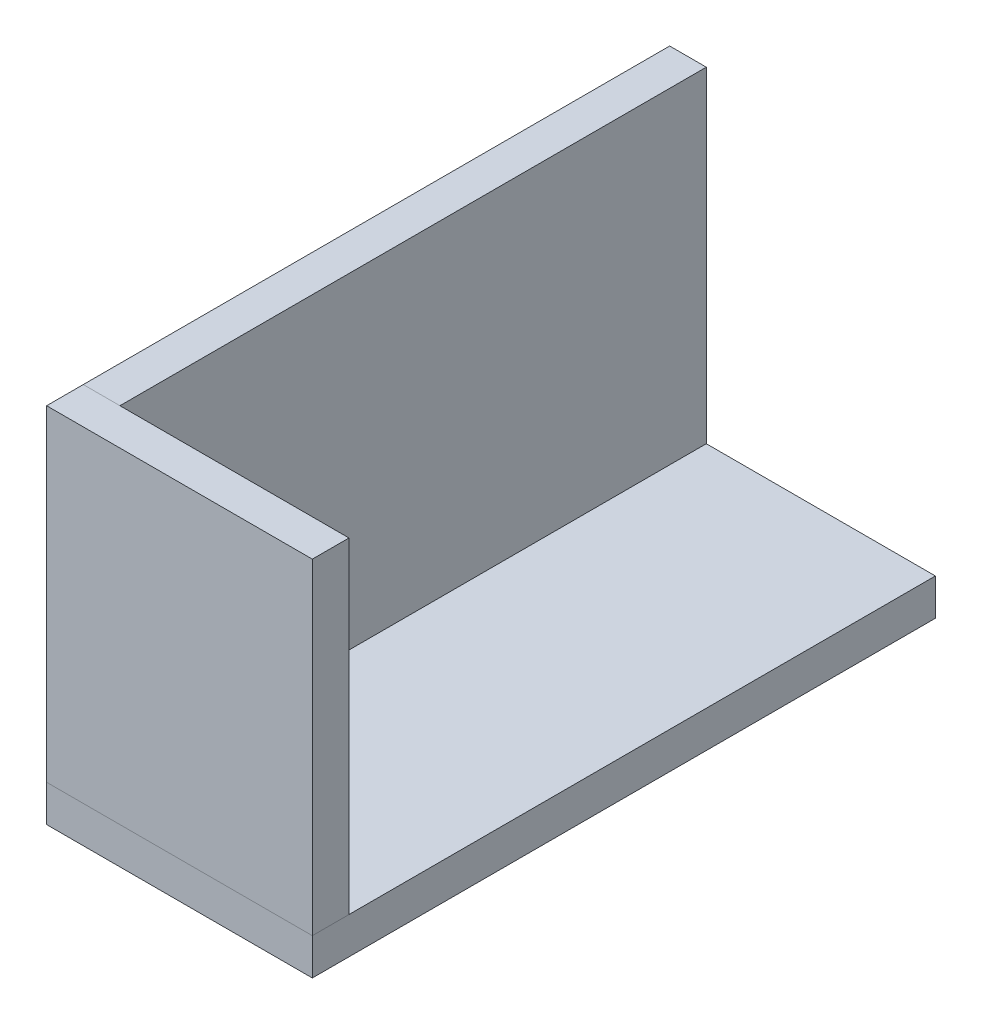
ISO-10303-21;
HEADER;
FILE_DESCRIPTION(('STEP AP214'),'2;1');
FILE_NAME('part.step','',(''),(''),'','','');
FILE_SCHEMA(('AUTOMOTIVE_DESIGN { 1 0 10303 214 1 1 1 1 }'));
ENDSEC;
DATA;
#1=APPLICATION_CONTEXT('core data for automotive mechanical design processes');
#2=APPLICATION_PROTOCOL_DEFINITION('international standard','automotive_design',2000,#1);
#3=PRODUCT_CONTEXT('',#1,'mechanical');
#4=PRODUCT('Part','Part','',(#3));
#5=PRODUCT_RELATED_PRODUCT_CATEGORY('part','',(#4));
#6=PRODUCT_DEFINITION_FORMATION('','',#4);
#7=PRODUCT_DEFINITION_CONTEXT('part definition',#1,'design');
#8=PRODUCT_DEFINITION('design','',#6,#7);
#9=PRODUCT_DEFINITION_SHAPE('','',#8);
#10=(LENGTH_UNIT() NAMED_UNIT(*) SI_UNIT(.MILLI.,.METRE.));
#11=(NAMED_UNIT(*) PLANE_ANGLE_UNIT() SI_UNIT($,.RADIAN.));
#12=(NAMED_UNIT(*) SI_UNIT($,.STERADIAN.) SOLID_ANGLE_UNIT());
#13=UNCERTAINTY_MEASURE_WITH_UNIT(LENGTH_MEASURE(1.E-05),#10,'distance_accuracy_value','');
#14=(GEOMETRIC_REPRESENTATION_CONTEXT(3) GLOBAL_UNCERTAINTY_ASSIGNED_CONTEXT((#13)) GLOBAL_UNIT_ASSIGNED_CONTEXT((#10,
#11,#12)) REPRESENTATION_CONTEXT('',''));
#15=CARTESIAN_POINT('',(0.,0.,0.));
#16=DIRECTION('',(0.,0.,1.));
#17=DIRECTION('',(1.,0.,0.));
#18=AXIS2_PLACEMENT_3D('',#15,#16,#17);
#19=CARTESIAN_POINT('',(-339.725,6858.02749999999,2899.41));
#20=DIRECTION('',(0.,-1.,0.));
#21=DIRECTION('',(0.,0.,-1.));
#22=AXIS2_PLACEMENT_3D('',#19,#20,#21);
#23=PLANE('',#22);
#24=CARTESIAN_POINT('',(-339.725,6858.02749999999,2855.31590000001));
#25=DIRECTION('',(0.,1.,0.));
#26=DIRECTION('',(0.,0.,1.));
#27=AXIS2_PLACEMENT_3D('',#24,#25,#26);
#28=CIRCLE('',#27,3.50000000000002);
#29=CARTESIAN_POINT('',(-339.725,6858.02749999999,2858.81590000001));
#30=VERTEX_POINT('',#29);
#31=EDGE_CURVE('P0_E83',#30,#30,#28,.T.);
#32=ORIENTED_EDGE('',*,*,#31,.T.);
#33=EDGE_LOOP('',(#32));
#34=FACE_BOUND('',#33,.T.);
#35=CARTESIAN_POINT('',(-339.725,6858.02749999999,2877.35040000001));
#36=DIRECTION('',(0.,1.,0.));
#37=DIRECTION('',(0.,0.,1.));
#38=AXIS2_PLACEMENT_3D('',#35,#36,#37);
#39=CIRCLE('',#38,3.50000000000002);
#40=CARTESIAN_POINT('',(-339.725,6858.02749999999,2880.85040000001));
#41=VERTEX_POINT('',#40);
#42=EDGE_CURVE('P0_E20',#41,#41,#39,.T.);
#43=ORIENTED_EDGE('',*,*,#42,.T.);
#44=EDGE_LOOP('',(#43));
#45=FACE_BOUND('',#44,.T.);
#46=DIRECTION('',(0.,0.,1.));
#47=VECTOR('',#46,1.);
#48=CARTESIAN_POINT('',(-377.825,6858.02749999999,2791.46));
#49=LINE('',#48,#47);
#50=CARTESIAN_POINT('',(-377.825,6858.02749999999,2683.51));
#51=VERTEX_POINT('',#50);
#52=CARTESIAN_POINT('',(-377.825,6858.02749999999,2899.41));
#53=VERTEX_POINT('',#52);
#54=EDGE_CURVE('P0_E70',#51,#53,#49,.T.);
#55=ORIENTED_EDGE('',*,*,#54,.F.);
#56=DIRECTION('',(-1.,0.,0.));
#57=VECTOR('',#56,1.);
#58=CARTESIAN_POINT('',(-339.725,6858.02749999999,2683.51));
#59=LINE('',#58,#57);
#60=CARTESIAN_POINT('',(-285.750000000016,6858.02749999999,2683.51));
#61=VERTEX_POINT('',#60);
#62=EDGE_CURVE('P0_E55',#61,#51,#59,.T.);
#63=ORIENTED_EDGE('',*,*,#62,.F.);
#64=DIRECTION('',(0.,0.,1.));
#65=VECTOR('',#64,1.);
#66=CARTESIAN_POINT('',(-285.750000000012,6858.02749999999,2791.46));
#67=LINE('',#66,#65);
#68=CARTESIAN_POINT('',(-285.750000000011,6858.02749999999,2899.41));
#69=VERTEX_POINT('',#68);
#70=EDGE_CURVE('P0_E60',#61,#69,#67,.T.);
#71=ORIENTED_EDGE('',*,*,#70,.T.);
#72=DIRECTION('',(1.,0.,0.));
#73=VECTOR('',#72,1.);
#74=CARTESIAN_POINT('',(-339.725,6858.02749999999,2899.41));
#75=LINE('',#74,#73);
#76=EDGE_CURVE('P0_E90',#53,#69,#75,.T.);
#77=ORIENTED_EDGE('',*,*,#76,.F.);
#78=EDGE_LOOP('',(#55,#63,#71,#77));
#79=FACE_BOUND('',#78,.T.);
#80=ADVANCED_FACE('P0_F17',(#34,#45,#79),#23,.T.);
#81=CARTESIAN_POINT('',(-285.750000000013,6864.37749999999,2791.46));
#82=DIRECTION('',(-1.,-1.19356260075187E-13,0.));
#83=DIRECTION('',(1.19356260075187E-13,-1.,0.));
#84=AXIS2_PLACEMENT_3D('',#81,#82,#83);
#85=PLANE('',#84);
#86=DIRECTION('',(0.,0.,1.));
#87=VECTOR('',#86,1.);
#88=CARTESIAN_POINT('',(-285.75000000001,6870.72749999999,2683.51));
#89=LINE('',#88,#87);
#90=CARTESIAN_POINT('',(-285.75000000001,6870.72749999999,2899.41));
#91=VERTEX_POINT('',#90);
#92=CARTESIAN_POINT('',(-285.750000000015,6870.72749999999,2683.51));
#93=VERTEX_POINT('',#92);
#94=EDGE_CURVE('P0_E85',#91,#93,#89,.F.);
#95=ORIENTED_EDGE('',*,*,#94,.F.);
#96=DIRECTION('',(0.,1.,0.));
#97=VECTOR('',#96,1.);
#98=CARTESIAN_POINT('',(-285.75000000001,6870.72749999999,2899.41));
#99=LINE('',#98,#97);
#100=EDGE_CURVE('P0_E65',#69,#91,#99,.T.);
#101=ORIENTED_EDGE('',*,*,#100,.F.);
#102=ORIENTED_EDGE('',*,*,#70,.F.);
#103=DIRECTION('',(0.,1.,0.));
#104=VECTOR('',#103,1.);
#105=CARTESIAN_POINT('',(-285.750000000018,6858.02749999999,2683.51));
#106=LINE('',#105,#104);
#107=EDGE_CURVE('P0_E62',#93,#61,#106,.F.);
#108=ORIENTED_EDGE('',*,*,#107,.F.);
#109=EDGE_LOOP('',(#95,#101,#102,#108));
#110=FACE_BOUND('',#109,.T.);
#111=ADVANCED_FACE('P0_F61',(#110),#85,.F.);
#112=CARTESIAN_POINT('',(-339.725,6858.02749999999,2683.51));
#113=DIRECTION('',(0.,0.,-1.));
#114=DIRECTION('',(-1.,0.,0.));
#115=AXIS2_PLACEMENT_3D('',#112,#113,#114);
#116=PLANE('',#115);
#117=DIRECTION('',(0.,1.,0.));
#118=VECTOR('',#117,1.);
#119=CARTESIAN_POINT('',(-377.825,6864.37749999999,2683.51));
#120=LINE('',#119,#118);
#121=CARTESIAN_POINT('',(-377.825,6870.72749999999,2683.51));
#122=VERTEX_POINT('',#121);
#123=EDGE_CURVE('P0_E72',#122,#51,#120,.F.);
#124=ORIENTED_EDGE('',*,*,#123,.F.);
#125=DIRECTION('',(1.,0.,0.));
#126=VECTOR('',#125,1.);
#127=CARTESIAN_POINT('',(-339.725,6870.72749999999,2683.51));
#128=LINE('',#127,#126);
#129=EDGE_CURVE('P0_E76',#93,#122,#128,.F.);
#130=ORIENTED_EDGE('',*,*,#129,.F.);
#131=ORIENTED_EDGE('',*,*,#107,.T.);
#132=ORIENTED_EDGE('',*,*,#62,.T.);
#133=EDGE_LOOP('',(#124,#130,#131,#132));
#134=FACE_BOUND('',#133,.T.);
#135=ADVANCED_FACE('P0_F74',(#134),#116,.T.);
#136=CARTESIAN_POINT('',(-377.825,6864.37749999999,2791.46));
#137=DIRECTION('',(-1.,0.,0.));
#138=DIRECTION('',(0.,0.,1.));
#139=AXIS2_PLACEMENT_3D('',#136,#137,#138);
#140=PLANE('',#139);
#141=ORIENTED_EDGE('',*,*,#54,.T.);
#142=DIRECTION('',(0.,1.,0.));
#143=VECTOR('',#142,1.);
#144=CARTESIAN_POINT('',(-377.825,6870.72749999999,2899.41));
#145=LINE('',#144,#143);
#146=CARTESIAN_POINT('',(-377.825,6870.72749999999,2899.41));
#147=VERTEX_POINT('',#146);
#148=EDGE_CURVE('P0_E35',#147,#53,#145,.F.);
#149=ORIENTED_EDGE('',*,*,#148,.F.);
#150=DIRECTION('',(0.,0.,1.));
#151=VECTOR('',#150,1.);
#152=CARTESIAN_POINT('',(-377.825,6870.72749999999,2683.51));
#153=LINE('',#152,#151);
#154=EDGE_CURVE('P0_E101',#122,#147,#153,.T.);
#155=ORIENTED_EDGE('',*,*,#154,.F.);
#156=ORIENTED_EDGE('',*,*,#123,.T.);
#157=EDGE_LOOP('',(#141,#149,#155,#156));
#158=FACE_BOUND('',#157,.T.);
#159=ADVANCED_FACE('P0_F99',(#158),#140,.T.);
#160=CARTESIAN_POINT('',(-339.725,6870.72749999999,2899.41));
#161=DIRECTION('',(0.,0.,1.));
#162=DIRECTION('',(1.,0.,0.));
#163=AXIS2_PLACEMENT_3D('',#160,#161,#162);
#164=PLANE('',#163);
#165=ORIENTED_EDGE('',*,*,#148,.T.);
#166=ORIENTED_EDGE('',*,*,#76,.T.);
#167=ORIENTED_EDGE('',*,*,#100,.T.);
#168=DIRECTION('',(1.,0.,0.));
#169=VECTOR('',#168,1.);
#170=CARTESIAN_POINT('',(-339.725,6870.72749999999,2899.41));
#171=LINE('',#170,#169);
#172=EDGE_CURVE('P0_E82',#147,#91,#171,.T.);
#173=ORIENTED_EDGE('',*,*,#172,.F.);
#174=EDGE_LOOP('',(#165,#166,#167,#173));
#175=FACE_BOUND('',#174,.T.);
#176=ADVANCED_FACE('P0_F107',(#175),#164,.T.);
#177=CARTESIAN_POINT('',(-339.725,6858.02749999999,2877.35040000001));
#178=DIRECTION('',(0.,1.,0.));
#179=DIRECTION('',(0.,0.,1.));
#180=AXIS2_PLACEMENT_3D('',#177,#178,#179);
#181=CYLINDRICAL_SURFACE('',#180,3.50000000000002);
#182=ORIENTED_EDGE('',*,*,#42,.F.);
#183=EDGE_LOOP('',(#182));
#184=FACE_BOUND('',#183,.T.);
#185=CARTESIAN_POINT('',(-339.725,6870.72749999999,2877.35040000001));
#186=DIRECTION('',(0.,1.,0.));
#187=DIRECTION('',(0.,0.,1.));
#188=AXIS2_PLACEMENT_3D('',#185,#186,#187);
#189=CIRCLE('',#188,3.50000000000002);
#190=CARTESIAN_POINT('',(-339.725,6870.72749999999,2880.85040000001));
#191=VERTEX_POINT('',#190);
#192=EDGE_CURVE('P0_E26',#191,#191,#189,.F.);
#193=ORIENTED_EDGE('',*,*,#192,.F.);
#194=EDGE_LOOP('',(#193));
#195=FACE_BOUND('',#194,.T.);
#196=ADVANCED_FACE('P0_F109',(#184,#195),#181,.F.);
#197=CARTESIAN_POINT('',(-339.725,6858.02749999999,2855.31590000001));
#198=DIRECTION('',(0.,1.,0.));
#199=DIRECTION('',(0.,0.,1.));
#200=AXIS2_PLACEMENT_3D('',#197,#198,#199);
#201=CYLINDRICAL_SURFACE('',#200,3.50000000000002);
#202=ORIENTED_EDGE('',*,*,#31,.F.);
#203=EDGE_LOOP('',(#202));
#204=FACE_BOUND('',#203,.T.);
#205=CARTESIAN_POINT('',(-339.725,6870.72749999999,2855.31590000001));
#206=DIRECTION('',(0.,1.,0.));
#207=DIRECTION('',(0.,0.,1.));
#208=AXIS2_PLACEMENT_3D('',#205,#206,#207);
#209=CIRCLE('',#208,3.50000000000002);
#210=CARTESIAN_POINT('',(-339.725,6870.72749999999,2858.81590000001));
#211=VERTEX_POINT('',#210);
#212=EDGE_CURVE('P0_E11',#211,#211,#209,.F.);
#213=ORIENTED_EDGE('',*,*,#212,.F.);
#214=EDGE_LOOP('',(#213));
#215=FACE_BOUND('',#214,.T.);
#216=ADVANCED_FACE('P0_F116',(#204,#215),#201,.F.);
#217=CARTESIAN_POINT('',(-339.725,6870.72749999999,2683.51));
#218=DIRECTION('',(0.,1.,0.));
#219=DIRECTION('',(0.,0.,1.));
#220=AXIS2_PLACEMENT_3D('',#217,#218,#219);
#221=PLANE('',#220);
#222=ORIENTED_EDGE('',*,*,#212,.T.);
#223=EDGE_LOOP('',(#222));
#224=FACE_BOUND('',#223,.T.);
#225=ORIENTED_EDGE('',*,*,#192,.T.);
#226=EDGE_LOOP('',(#225));
#227=FACE_BOUND('',#226,.T.);
#228=ORIENTED_EDGE('',*,*,#154,.T.);
#229=ORIENTED_EDGE('',*,*,#172,.T.);
#230=ORIENTED_EDGE('',*,*,#94,.T.);
#231=ORIENTED_EDGE('',*,*,#129,.T.);
#232=EDGE_LOOP('',(#228,#229,#230,#231));
#233=FACE_BOUND('',#232,.T.);
#234=ADVANCED_FACE('P0_F105',(#224,#227,#233),#221,.T.);
#235=CLOSED_SHELL('',(#80,#111,#135,#159,#176,#196,#216,#234));
#236=MANIFOLD_SOLID_BREP('P0_B1',#235);
#237=CARTESIAN_POINT('',(-377.825,6870.72749999999,2899.41));
#238=DIRECTION('',(0.,0.,1.));
#239=DIRECTION('',(1.,0.,0.));
#240=AXIS2_PLACEMENT_3D('',#237,#238,#239);
#241=PLANE('',#240);
#242=DIRECTION('',(1.,0.,0.));
#243=VECTOR('',#242,1.);
#244=CARTESIAN_POINT('',(-331.787500000005,6870.72749999999,2899.41));
#245=LINE('',#244,#243);
#246=CARTESIAN_POINT('',(-377.825,6870.72749999999,2899.41));
#247=VERTEX_POINT('',#246);
#248=CARTESIAN_POINT('',(-285.75000000001,6870.72749999999,2899.41));
#249=VERTEX_POINT('',#248);
#250=EDGE_CURVE('P1_E55',#247,#249,#245,.T.);
#251=ORIENTED_EDGE('',*,*,#250,.T.);
#252=DIRECTION('',(0.,1.,0.));
#253=VECTOR('',#252,1.);
#254=CARTESIAN_POINT('',(-285.75000000001,6870.72749999999,2899.41));
#255=LINE('',#254,#253);
#256=CARTESIAN_POINT('',(-285.75000000001,6983.72999014005,2899.41));
#257=VERTEX_POINT('',#256);
#258=EDGE_CURVE('P1_E67',#257,#249,#255,.F.);
#259=ORIENTED_EDGE('',*,*,#258,.F.);
#260=DIRECTION('',(1.,1.19356260075187E-13,0.));
#261=VECTOR('',#260,1.);
#262=CARTESIAN_POINT('',(-331.787500000005,6983.72999014005,2899.41));
#263=LINE('',#262,#261);
#264=CARTESIAN_POINT('',(-377.825,6983.72999014005,2899.41));
#265=VERTEX_POINT('',#264);
#266=EDGE_CURVE('P1_E20',#257,#265,#263,.F.);
#267=ORIENTED_EDGE('',*,*,#266,.T.);
#268=DIRECTION('',(0.,1.,0.));
#269=VECTOR('',#268,1.);
#270=CARTESIAN_POINT('',(-377.825,6870.72749999999,2899.41));
#271=LINE('',#270,#269);
#272=EDGE_CURVE('P1_E81',#247,#265,#271,.T.);
#273=ORIENTED_EDGE('',*,*,#272,.F.);
#274=EDGE_LOOP('',(#251,#259,#267,#273));
#275=FACE_BOUND('',#274,.T.);
#276=ADVANCED_FACE('P1_F17',(#275),#241,.T.);
#277=CARTESIAN_POINT('',(-331.787500000005,6983.72999014005,2893.06));
#278=DIRECTION('',(1.19356260075187E-13,-1.,0.));
#279=DIRECTION('',(1.,1.19356260075187E-13,0.));
#280=AXIS2_PLACEMENT_3D('',#277,#278,#279);
#281=PLANE('',#280);
#282=DIRECTION('',(0.,0.,1.));
#283=VECTOR('',#282,1.);
#284=CARTESIAN_POINT('',(-377.825,6983.72999014005,2886.71));
#285=LINE('',#284,#283);
#286=CARTESIAN_POINT('',(-377.825,6983.72999014005,2886.71));
#287=VERTEX_POINT('',#286);
#288=EDGE_CURVE('P1_E65',#265,#287,#285,.F.);
#289=ORIENTED_EDGE('',*,*,#288,.F.);
#290=ORIENTED_EDGE('',*,*,#266,.F.);
#291=DIRECTION('',(0.,0.,-1.));
#292=VECTOR('',#291,1.);
#293=CARTESIAN_POINT('',(-285.75000000001,6983.72999014005,2899.41));
#294=LINE('',#293,#292);
#295=CARTESIAN_POINT('',(-285.75000000001,6983.72999014005,2886.71));
#296=VERTEX_POINT('',#295);
#297=EDGE_CURVE('P1_E62',#296,#257,#294,.F.);
#298=ORIENTED_EDGE('',*,*,#297,.F.);
#299=DIRECTION('',(-1.,0.,0.));
#300=VECTOR('',#299,1.);
#301=CARTESIAN_POINT('',(-285.75000000001,6983.72999014005,2886.71));
#302=LINE('',#301,#300);
#303=EDGE_CURVE('P1_E83',#287,#296,#302,.F.);
#304=ORIENTED_EDGE('',*,*,#303,.F.);
#305=EDGE_LOOP('',(#289,#290,#298,#304));
#306=FACE_BOUND('',#305,.T.);
#307=ADVANCED_FACE('P1_F60',(#306),#281,.F.);
#308=CARTESIAN_POINT('',(-285.75000000001,6870.72749999999,2899.41));
#309=DIRECTION('',(1.,0.,0.));
#310=DIRECTION('',(0.,0.,-1.));
#311=AXIS2_PLACEMENT_3D('',#308,#309,#310);
#312=PLANE('',#311);
#313=DIRECTION('',(0.,0.,1.));
#314=VECTOR('',#313,1.);
#315=CARTESIAN_POINT('',(-285.75000000001,6870.72749999999,2893.06));
#316=LINE('',#315,#314);
#317=CARTESIAN_POINT('',(-285.75000000001,6870.72749999999,2886.71));
#318=VERTEX_POINT('',#317);
#319=EDGE_CURVE('P1_E77',#249,#318,#316,.F.);
#320=ORIENTED_EDGE('',*,*,#319,.T.);
#321=DIRECTION('',(0.,1.,0.));
#322=VECTOR('',#321,1.);
#323=CARTESIAN_POINT('',(-285.75000000001,6870.72749999999,2886.71));
#324=LINE('',#323,#322);
#325=EDGE_CURVE('P1_E73',#296,#318,#324,.F.);
#326=ORIENTED_EDGE('',*,*,#325,.F.);
#327=ORIENTED_EDGE('',*,*,#297,.T.);
#328=ORIENTED_EDGE('',*,*,#258,.T.);
#329=EDGE_LOOP('',(#320,#326,#327,#328));
#330=FACE_BOUND('',#329,.T.);
#331=ADVANCED_FACE('P1_F71',(#330),#312,.T.);
#332=CARTESIAN_POINT('',(-331.787500000005,6870.72749999999,2893.06));
#333=DIRECTION('',(0.,1.,0.));
#334=DIRECTION('',(0.,0.,1.));
#335=AXIS2_PLACEMENT_3D('',#332,#333,#334);
#336=PLANE('',#335);
#337=DIRECTION('',(-1.,0.,0.));
#338=VECTOR('',#337,1.);
#339=CARTESIAN_POINT('',(-285.75000000001,6870.72749999999,2886.71));
#340=LINE('',#339,#338);
#341=CARTESIAN_POINT('',(-377.825,6870.72749999999,2886.71));
#342=VERTEX_POINT('',#341);
#343=EDGE_CURVE('P1_E26',#318,#342,#340,.T.);
#344=ORIENTED_EDGE('',*,*,#343,.F.);
#345=ORIENTED_EDGE('',*,*,#319,.F.);
#346=ORIENTED_EDGE('',*,*,#250,.F.);
#347=DIRECTION('',(0.,0.,1.));
#348=VECTOR('',#347,1.);
#349=CARTESIAN_POINT('',(-377.825,6870.72749999999,2886.71));
#350=LINE('',#349,#348);
#351=EDGE_CURVE('P1_E35',#342,#247,#350,.T.);
#352=ORIENTED_EDGE('',*,*,#351,.F.);
#353=EDGE_LOOP('',(#344,#345,#346,#352));
#354=FACE_BOUND('',#353,.T.);
#355=ADVANCED_FACE('P1_F89',(#354),#336,.F.);
#356=CARTESIAN_POINT('',(-377.825,6870.72749999999,2886.71));
#357=DIRECTION('',(-1.,0.,0.));
#358=DIRECTION('',(0.,0.,1.));
#359=AXIS2_PLACEMENT_3D('',#356,#357,#358);
#360=PLANE('',#359);
#361=ORIENTED_EDGE('',*,*,#351,.T.);
#362=ORIENTED_EDGE('',*,*,#272,.T.);
#363=ORIENTED_EDGE('',*,*,#288,.T.);
#364=DIRECTION('',(0.,1.,0.));
#365=VECTOR('',#364,1.);
#366=CARTESIAN_POINT('',(-377.825,6870.72749999999,2886.71));
#367=LINE('',#366,#365);
#368=EDGE_CURVE('P1_E11',#342,#287,#367,.T.);
#369=ORIENTED_EDGE('',*,*,#368,.F.);
#370=EDGE_LOOP('',(#361,#362,#363,#369));
#371=FACE_BOUND('',#370,.T.);
#372=ADVANCED_FACE('P1_F91',(#371),#360,.T.);
#373=CARTESIAN_POINT('',(-285.75000000001,6870.72749999999,2886.71));
#374=DIRECTION('',(0.,0.,-1.));
#375=DIRECTION('',(-1.,0.,0.));
#376=AXIS2_PLACEMENT_3D('',#373,#374,#375);
#377=PLANE('',#376);
#378=ORIENTED_EDGE('',*,*,#343,.T.);
#379=ORIENTED_EDGE('',*,*,#368,.T.);
#380=ORIENTED_EDGE('',*,*,#303,.T.);
#381=ORIENTED_EDGE('',*,*,#325,.T.);
#382=EDGE_LOOP('',(#378,#379,#380,#381));
#383=FACE_BOUND('',#382,.T.);
#384=ADVANCED_FACE('P1_F88',(#383),#377,.T.);
#385=CLOSED_SHELL('',(#276,#307,#331,#355,#372,#384));
#386=MANIFOLD_SOLID_BREP('P1_B1',#385);
#387=CARTESIAN_POINT('',(-365.125,6870.72749999999,2886.71));
#388=DIRECTION('',(1.,0.,0.));
#389=DIRECTION('',(0.,0.,-1.));
#390=AXIS2_PLACEMENT_3D('',#387,#388,#389);
#391=PLANE('',#390);
#392=DIRECTION('',(0.,0.,1.));
#393=VECTOR('',#392,1.);
#394=CARTESIAN_POINT('',(-365.125,6870.72749999999,2785.11));
#395=LINE('',#394,#393);
#396=CARTESIAN_POINT('',(-365.125,6870.72749999999,2886.71));
#397=VERTEX_POINT('',#396);
#398=CARTESIAN_POINT('',(-365.125,6870.72749999999,2683.51));
#399=VERTEX_POINT('',#398);
#400=EDGE_CURVE('P2_E55',#397,#399,#395,.F.);
#401=ORIENTED_EDGE('',*,*,#400,.T.);
#402=DIRECTION('',(0.,1.,0.));
#403=VECTOR('',#402,1.);
#404=CARTESIAN_POINT('',(-365.125,6870.72749999999,2683.51));
#405=LINE('',#404,#403);
#406=CARTESIAN_POINT('',(-365.125,6983.72999014005,2683.51));
#407=VERTEX_POINT('',#406);
#408=EDGE_CURVE('P2_E67',#407,#399,#405,.F.);
#409=ORIENTED_EDGE('',*,*,#408,.F.);
#410=DIRECTION('',(0.,0.,1.));
#411=VECTOR('',#410,1.);
#412=CARTESIAN_POINT('',(-365.125,6983.72999014005,2785.11));
#413=LINE('',#412,#411);
#414=CARTESIAN_POINT('',(-365.125,6983.72999014005,2886.71));
#415=VERTEX_POINT('',#414);
#416=EDGE_CURVE('P2_E20',#407,#415,#413,.T.);
#417=ORIENTED_EDGE('',*,*,#416,.T.);
#418=DIRECTION('',(0.,1.,0.));
#419=VECTOR('',#418,1.);
#420=CARTESIAN_POINT('',(-365.125,6870.72749999999,2886.71));
#421=LINE('',#420,#419);
#422=EDGE_CURVE('P2_E81',#397,#415,#421,.T.);
#423=ORIENTED_EDGE('',*,*,#422,.F.);
#424=EDGE_LOOP('',(#401,#409,#417,#423));
#425=FACE_BOUND('',#424,.T.);
#426=ADVANCED_FACE('P2_F17',(#425),#391,.T.);
#427=CARTESIAN_POINT('',(-371.475,6983.72999014005,2785.11));
#428=DIRECTION('',(1.19356260075187E-13,-1.,0.));
#429=DIRECTION('',(1.,1.19356260075187E-13,0.));
#430=AXIS2_PLACEMENT_3D('',#427,#428,#429);
#431=PLANE('',#430);
#432=DIRECTION('',(0.,0.,1.));
#433=VECTOR('',#432,1.);
#434=CARTESIAN_POINT('',(-377.825,6983.72999014005,2683.51));
#435=LINE('',#434,#433);
#436=CARTESIAN_POINT('',(-377.825,6983.72999014005,2886.71));
#437=VERTEX_POINT('',#436);
#438=CARTESIAN_POINT('',(-377.825,6983.72999014005,2683.51));
#439=VERTEX_POINT('',#438);
#440=EDGE_CURVE('P2_E83',#437,#439,#435,.F.);
#441=ORIENTED_EDGE('',*,*,#440,.F.);
#442=DIRECTION('',(1.,0.,0.));
#443=VECTOR('',#442,1.);
#444=CARTESIAN_POINT('',(-377.825,6983.72999014005,2886.71));
#445=LINE('',#444,#443);
#446=EDGE_CURVE('P2_E65',#415,#437,#445,.F.);
#447=ORIENTED_EDGE('',*,*,#446,.F.);
#448=ORIENTED_EDGE('',*,*,#416,.F.);
#449=DIRECTION('',(-1.,0.,0.));
#450=VECTOR('',#449,1.);
#451=CARTESIAN_POINT('',(-365.125,6983.72999014005,2683.51));
#452=LINE('',#451,#450);
#453=EDGE_CURVE('P2_E62',#439,#407,#452,.F.);
#454=ORIENTED_EDGE('',*,*,#453,.F.);
#455=EDGE_LOOP('',(#441,#447,#448,#454));
#456=FACE_BOUND('',#455,.T.);
#457=ADVANCED_FACE('P2_F60',(#456),#431,.F.);
#458=CARTESIAN_POINT('',(-365.125,6870.72749999999,2683.51));
#459=DIRECTION('',(0.,0.,-1.));
#460=DIRECTION('',(-1.,0.,0.));
#461=AXIS2_PLACEMENT_3D('',#458,#459,#460);
#462=PLANE('',#461);
#463=DIRECTION('',(1.,0.,0.));
#464=VECTOR('',#463,1.);
#465=CARTESIAN_POINT('',(-371.475,6870.72749999999,2683.51));
#466=LINE('',#465,#464);
#467=CARTESIAN_POINT('',(-377.825,6870.72749999999,2683.51));
#468=VERTEX_POINT('',#467);
#469=EDGE_CURVE('P2_E77',#399,#468,#466,.F.);
#470=ORIENTED_EDGE('',*,*,#469,.T.);
#471=DIRECTION('',(0.,1.,0.));
#472=VECTOR('',#471,1.);
#473=CARTESIAN_POINT('',(-377.825,6870.72749999999,2683.51));
#474=LINE('',#473,#472);
#475=EDGE_CURVE('P2_E73',#439,#468,#474,.F.);
#476=ORIENTED_EDGE('',*,*,#475,.F.);
#477=ORIENTED_EDGE('',*,*,#453,.T.);
#478=ORIENTED_EDGE('',*,*,#408,.T.);
#479=EDGE_LOOP('',(#470,#476,#477,#478));
#480=FACE_BOUND('',#479,.T.);
#481=ADVANCED_FACE('P2_F71',(#480),#462,.T.);
#482=CARTESIAN_POINT('',(-371.475,6870.72749999999,2785.11));
#483=DIRECTION('',(0.,1.,0.));
#484=DIRECTION('',(0.,0.,1.));
#485=AXIS2_PLACEMENT_3D('',#482,#483,#484);
#486=PLANE('',#485);
#487=ORIENTED_EDGE('',*,*,#469,.F.);
#488=ORIENTED_EDGE('',*,*,#400,.F.);
#489=DIRECTION('',(1.,0.,0.));
#490=VECTOR('',#489,1.);
#491=CARTESIAN_POINT('',(-377.825,6870.72749999999,2886.71));
#492=LINE('',#491,#490);
#493=CARTESIAN_POINT('',(-377.825,6870.72749999999,2886.71));
#494=VERTEX_POINT('',#493);
#495=EDGE_CURVE('P2_E35',#494,#397,#492,.T.);
#496=ORIENTED_EDGE('',*,*,#495,.F.);
#497=DIRECTION('',(0.,0.,1.));
#498=VECTOR('',#497,1.);
#499=CARTESIAN_POINT('',(-377.825,6870.72749999999,2683.51));
#500=LINE('',#499,#498);
#501=EDGE_CURVE('P2_E26',#468,#494,#500,.T.);
#502=ORIENTED_EDGE('',*,*,#501,.F.);
#503=EDGE_LOOP('',(#487,#488,#496,#502));
#504=FACE_BOUND('',#503,.T.);
#505=ADVANCED_FACE('P2_F89',(#504),#486,.F.);
#506=CARTESIAN_POINT('',(-377.825,6870.72749999999,2886.71));
#507=DIRECTION('',(0.,0.,1.));
#508=DIRECTION('',(1.,0.,0.));
#509=AXIS2_PLACEMENT_3D('',#506,#507,#508);
#510=PLANE('',#509);
#511=ORIENTED_EDGE('',*,*,#495,.T.);
#512=ORIENTED_EDGE('',*,*,#422,.T.);
#513=ORIENTED_EDGE('',*,*,#446,.T.);
#514=DIRECTION('',(0.,1.,0.));
#515=VECTOR('',#514,1.);
#516=CARTESIAN_POINT('',(-377.825,6870.72749999999,2886.71));
#517=LINE('',#516,#515);
#518=EDGE_CURVE('P2_E11',#494,#437,#517,.T.);
#519=ORIENTED_EDGE('',*,*,#518,.F.);
#520=EDGE_LOOP('',(#511,#512,#513,#519));
#521=FACE_BOUND('',#520,.T.);
#522=ADVANCED_FACE('P2_F91',(#521),#510,.T.);
#523=CARTESIAN_POINT('',(-377.825,6870.72749999999,2683.51));
#524=DIRECTION('',(-1.,0.,0.));
#525=DIRECTION('',(0.,0.,1.));
#526=AXIS2_PLACEMENT_3D('',#523,#524,#525);
#527=PLANE('',#526);
#528=ORIENTED_EDGE('',*,*,#501,.T.);
#529=ORIENTED_EDGE('',*,*,#518,.T.);
#530=ORIENTED_EDGE('',*,*,#440,.T.);
#531=ORIENTED_EDGE('',*,*,#475,.T.);
#532=EDGE_LOOP('',(#528,#529,#530,#531));
#533=FACE_BOUND('',#532,.T.);
#534=ADVANCED_FACE('P2_F88',(#533),#527,.T.);
#535=CLOSED_SHELL('',(#426,#457,#481,#505,#522,#534));
#536=MANIFOLD_SOLID_BREP('P2_B1',#535);
#537=ADVANCED_BREP_SHAPE_REPRESENTATION('',(#18,#236,#386,#536),#14);
#538=SHAPE_DEFINITION_REPRESENTATION(#9,#537);
ENDSEC;
END-ISO-10303-21;
